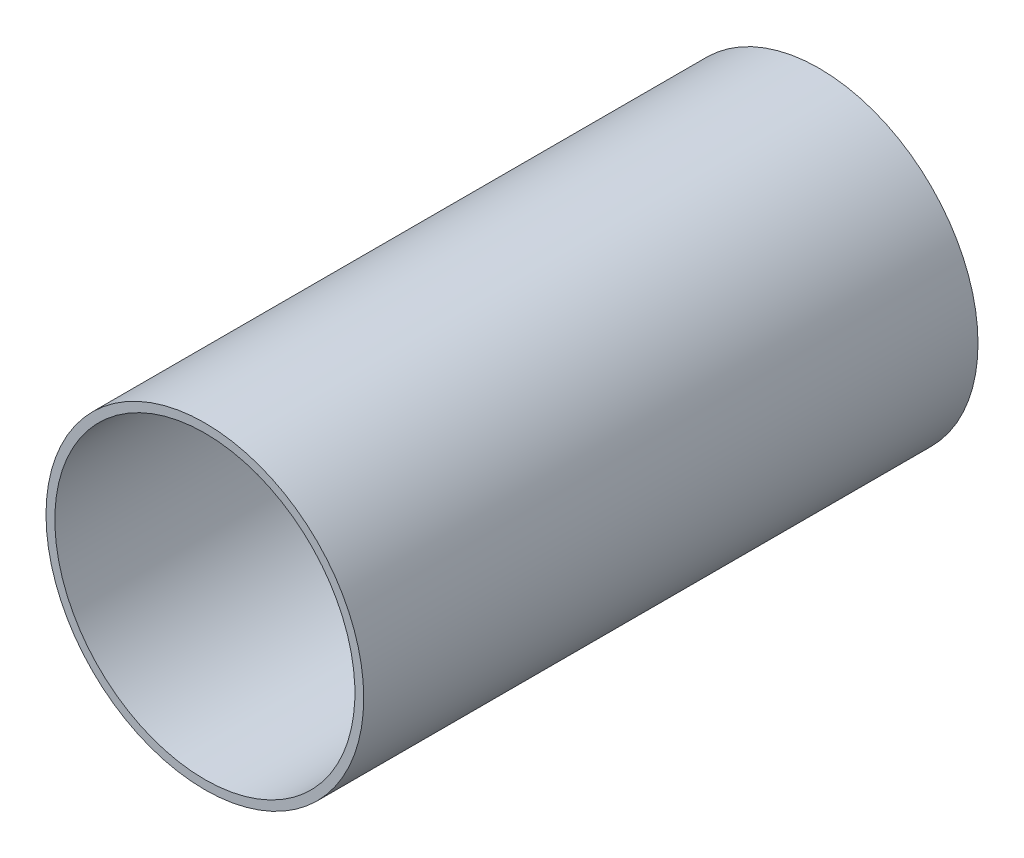
ISO-10303-21;
HEADER;
FILE_DESCRIPTION(('STEP AP214'),'2;1');
FILE_NAME('part.step','',(''),(''),'','','');
FILE_SCHEMA(('AUTOMOTIVE_DESIGN { 1 0 10303 214 1 1 1 1 }'));
ENDSEC;
DATA;
#1=APPLICATION_CONTEXT('core data for automotive mechanical design processes');
#2=APPLICATION_PROTOCOL_DEFINITION('international standard','automotive_design',2000,#1);
#3=PRODUCT_CONTEXT('',#1,'mechanical');
#4=PRODUCT('Part','Part','',(#3));
#5=PRODUCT_RELATED_PRODUCT_CATEGORY('part','',(#4));
#6=PRODUCT_DEFINITION_FORMATION('','',#4);
#7=PRODUCT_DEFINITION_CONTEXT('part definition',#1,'design');
#8=PRODUCT_DEFINITION('design','',#6,#7);
#9=PRODUCT_DEFINITION_SHAPE('','',#8);
#10=(LENGTH_UNIT() NAMED_UNIT(*) SI_UNIT(.MILLI.,.METRE.));
#11=(NAMED_UNIT(*) PLANE_ANGLE_UNIT() SI_UNIT($,.RADIAN.));
#12=(NAMED_UNIT(*) SI_UNIT($,.STERADIAN.) SOLID_ANGLE_UNIT());
#13=UNCERTAINTY_MEASURE_WITH_UNIT(LENGTH_MEASURE(1.E-05),#10,'distance_accuracy_value','');
#14=(GEOMETRIC_REPRESENTATION_CONTEXT(3) GLOBAL_UNCERTAINTY_ASSIGNED_CONTEXT((#13)) GLOBAL_UNIT_ASSIGNED_CONTEXT((#10,
#11,#12)) REPRESENTATION_CONTEXT('',''));
#15=CARTESIAN_POINT('',(0.,0.,0.));
#16=DIRECTION('',(0.,0.,1.));
#17=DIRECTION('',(1.,0.,0.));
#18=AXIS2_PLACEMENT_3D('',#15,#16,#17);
#19=CARTESIAN_POINT('',(172.8978,-71.2108,-0.045));
#20=DIRECTION('',(0.,0.,-1.));
#21=DIRECTION('',(0.,-1.,0.));
#22=AXIS2_PLACEMENT_3D('',#19,#20,#21);
#23=CYLINDRICAL_SURFACE('',#22,0.425);
#24=CARTESIAN_POINT('',(172.8978,-71.2108,-0.035));
#25=DIRECTION('',(0.,0.,-1.));
#26=DIRECTION('',(0.,-1.,0.));
#27=AXIS2_PLACEMENT_3D('',#24,#25,#26);
#28=CIRCLE('',#27,0.425);
#29=CARTESIAN_POINT('',(172.8978,-71.6358,-0.035));
#30=VERTEX_POINT('',#29);
#31=EDGE_CURVE('E65',#30,#30,#28,.T.);
#32=ORIENTED_EDGE('',*,*,#31,.T.);
#33=DIRECTION('',(0.,0.,1.));
#34=VECTOR('',#33,1.);
#35=CARTESIAN_POINT('',(172.8978,-71.6358,-0.045));
#36=LINE('',#35,#34);
#37=CARTESIAN_POINT('',(172.8978,-71.6358,1.705));
#38=VERTEX_POINT('',#37);
#39=EDGE_CURVE('E11',#30,#38,#36,.T.);
#40=ORIENTED_EDGE('',*,*,#39,.T.);
#41=CARTESIAN_POINT('',(172.8978,-71.2108,1.705));
#42=DIRECTION('',(0.,0.,-1.));
#43=DIRECTION('',(0.,-1.,0.));
#44=AXIS2_PLACEMENT_3D('',#41,#42,#43);
#45=CIRCLE('',#44,0.425);
#46=EDGE_CURVE('E20',#38,#38,#45,.T.);
#47=ORIENTED_EDGE('',*,*,#46,.F.);
#48=ORIENTED_EDGE('',*,*,#39,.F.);
#49=EDGE_LOOP('',(#32,#40,#47,#48));
#50=FACE_BOUND('',#49,.T.);
#51=ADVANCED_FACE('F17',(#50),#23,.F.);
#52=CARTESIAN_POINT('',(172.8978,-71.6608,1.705));
#53=DIRECTION('',(0.,0.,1.));
#54=DIRECTION('',(1.,0.,0.));
#55=AXIS2_PLACEMENT_3D('',#52,#53,#54);
#56=PLANE('',#55);
#57=ORIENTED_EDGE('',*,*,#46,.T.);
#58=EDGE_LOOP('',(#57));
#59=FACE_BOUND('',#58,.T.);
#60=CARTESIAN_POINT('',(172.8978,-71.2108,1.705));
#61=DIRECTION('',(0.,0.,1.));
#62=DIRECTION('',(0.,-1.,0.));
#63=AXIS2_PLACEMENT_3D('',#60,#61,#62);
#64=CIRCLE('',#63,0.45);
#65=CARTESIAN_POINT('',(172.8978,-71.6608,1.705));
#66=VERTEX_POINT('',#65);
#67=EDGE_CURVE('E57',#66,#66,#64,.T.);
#68=ORIENTED_EDGE('',*,*,#67,.T.);
#69=EDGE_LOOP('',(#68));
#70=FACE_BOUND('',#69,.T.);
#71=ADVANCED_FACE('F76',(#59,#70),#56,.T.);
#72=CARTESIAN_POINT('',(172.8978,-71.6608,-0.035));
#73=DIRECTION('',(0.,0.,1.));
#74=DIRECTION('',(1.,0.,0.));
#75=AXIS2_PLACEMENT_3D('',#72,#73,#74);
#76=PLANE('',#75);
#77=ORIENTED_EDGE('',*,*,#31,.F.);
#78=EDGE_LOOP('',(#77));
#79=FACE_BOUND('',#78,.T.);
#80=CARTESIAN_POINT('',(172.8978,-71.2108,-0.035));
#81=DIRECTION('',(0.,0.,1.));
#82=DIRECTION('',(0.,-1.,0.));
#83=AXIS2_PLACEMENT_3D('',#80,#81,#82);
#84=CIRCLE('',#83,0.45);
#85=CARTESIAN_POINT('',(172.8978,-71.6608,-0.035));
#86=VERTEX_POINT('',#85);
#87=EDGE_CURVE('E56',#86,#86,#84,.T.);
#88=ORIENTED_EDGE('',*,*,#87,.F.);
#89=EDGE_LOOP('',(#88));
#90=FACE_BOUND('',#89,.T.);
#91=ADVANCED_FACE('F84',(#79,#90),#76,.F.);
#92=CARTESIAN_POINT('',(172.8978,-71.2108,-0.035));
#93=DIRECTION('',(0.,0.,-1.));
#94=DIRECTION('',(0.,-1.,0.));
#95=AXIS2_PLACEMENT_3D('',#92,#93,#94);
#96=CYLINDRICAL_SURFACE('',#95,0.45);
#97=ORIENTED_EDGE('',*,*,#87,.T.);
#98=DIRECTION('',(0.,0.,1.));
#99=VECTOR('',#98,1.);
#100=CARTESIAN_POINT('',(172.8978,-71.6608,-0.035));
#101=LINE('',#100,#99);
#102=EDGE_CURVE('E53',#86,#66,#101,.T.);
#103=ORIENTED_EDGE('',*,*,#102,.T.);
#104=ORIENTED_EDGE('',*,*,#67,.F.);
#105=ORIENTED_EDGE('',*,*,#102,.F.);
#106=EDGE_LOOP('',(#97,#103,#104,#105));
#107=FACE_BOUND('',#106,.T.);
#108=ADVANCED_FACE('F54',(#107),#96,.T.);
#109=CLOSED_SHELL('',(#51,#71,#91,#108));
#110=MANIFOLD_SOLID_BREP('B1',#109);
#111=ADVANCED_BREP_SHAPE_REPRESENTATION('',(#18,#110),#14);
#112=SHAPE_DEFINITION_REPRESENTATION(#9,#111);
ENDSEC;
END-ISO-10303-21;
